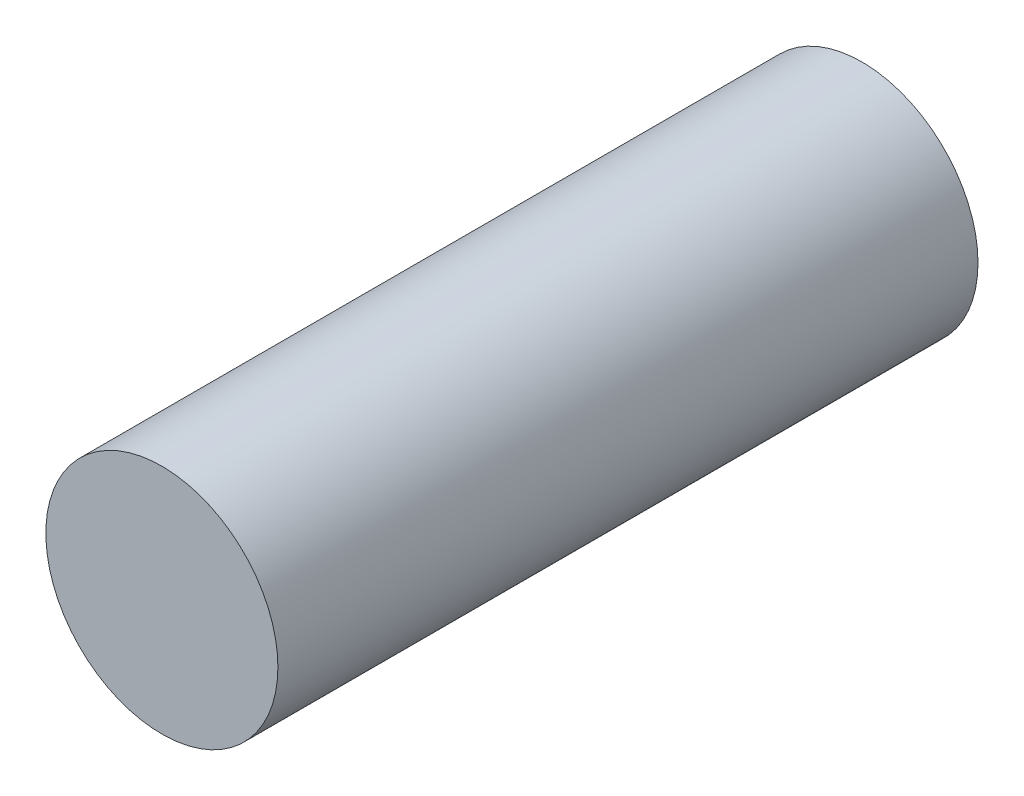
ISO-10303-21;
HEADER;
FILE_DESCRIPTION(('STEP AP214'),'2;1');
FILE_NAME('part.step','',(''),(''),'','','');
FILE_SCHEMA(('AUTOMOTIVE_DESIGN { 1 0 10303 214 1 1 1 1 }'));
ENDSEC;
DATA;
#1=APPLICATION_CONTEXT('core data for automotive mechanical design processes');
#2=APPLICATION_PROTOCOL_DEFINITION('international standard','automotive_design',2000,#1);
#3=PRODUCT_CONTEXT('',#1,'mechanical');
#4=PRODUCT('Part','Part','',(#3));
#5=PRODUCT_RELATED_PRODUCT_CATEGORY('part','',(#4));
#6=PRODUCT_DEFINITION_FORMATION('','',#4);
#7=PRODUCT_DEFINITION_CONTEXT('part definition',#1,'design');
#8=PRODUCT_DEFINITION('design','',#6,#7);
#9=PRODUCT_DEFINITION_SHAPE('','',#8);
#10=(LENGTH_UNIT() NAMED_UNIT(*) SI_UNIT(.MILLI.,.METRE.));
#11=(NAMED_UNIT(*) PLANE_ANGLE_UNIT() SI_UNIT($,.RADIAN.));
#12=(NAMED_UNIT(*) SI_UNIT($,.STERADIAN.) SOLID_ANGLE_UNIT());
#13=UNCERTAINTY_MEASURE_WITH_UNIT(LENGTH_MEASURE(1.E-05),#10,'distance_accuracy_value','');
#14=(GEOMETRIC_REPRESENTATION_CONTEXT(3) GLOBAL_UNCERTAINTY_ASSIGNED_CONTEXT((#13)) GLOBAL_UNIT_ASSIGNED_CONTEXT((#10,
#11,#12)) REPRESENTATION_CONTEXT('',''));
#15=CARTESIAN_POINT('',(0.,0.,0.));
#16=DIRECTION('',(0.,0.,1.));
#17=DIRECTION('',(1.,0.,0.));
#18=AXIS2_PLACEMENT_3D('',#15,#16,#17);
#19=CARTESIAN_POINT('',(0.,0.,-9.779));
#20=DIRECTION('',(0.,0.,1.));
#21=DIRECTION('',(1.,0.,0.));
#22=AXIS2_PLACEMENT_3D('',#19,#20,#21);
#23=PLANE('',#22);
#24=CARTESIAN_POINT('',(0.,0.,-9.779));
#25=DIRECTION('',(0.,0.,1.));
#26=DIRECTION('',(1.,0.,0.));
#27=AXIS2_PLACEMENT_3D('',#24,#25,#26);
#28=CIRCLE('',#27,3.175);
#29=CARTESIAN_POINT('',(3.175,0.,-9.779));
#30=VERTEX_POINT('',#29);
#31=EDGE_CURVE('E17',#30,#30,#28,.T.);
#32=ORIENTED_EDGE('',*,*,#31,.F.);
#33=EDGE_LOOP('',(#32));
#34=FACE_BOUND('',#33,.T.);
#35=ADVANCED_FACE('F13',(#34),#23,.F.);
#36=CARTESIAN_POINT('',(0.,0.,9.379));
#37=DIRECTION('',(0.,0.,1.));
#38=DIRECTION('',(1.,0.,0.));
#39=AXIS2_PLACEMENT_3D('',#36,#37,#38);
#40=PLANE('',#39);
#41=CARTESIAN_POINT('',(0.,0.,9.379));
#42=DIRECTION('',(0.,0.,1.));
#43=DIRECTION('',(1.,0.,0.));
#44=AXIS2_PLACEMENT_3D('',#41,#42,#43);
#45=CIRCLE('',#44,3.175);
#46=CARTESIAN_POINT('',(3.175,0.,9.379));
#47=VERTEX_POINT('',#46);
#48=EDGE_CURVE('E9',#47,#47,#45,.T.);
#49=ORIENTED_EDGE('',*,*,#48,.T.);
#50=EDGE_LOOP('',(#49));
#51=FACE_BOUND('',#50,.T.);
#52=ADVANCED_FACE('F15',(#51),#40,.T.);
#53=CARTESIAN_POINT('',(0.,0.,-12.465));
#54=DIRECTION('',(0.,0.,1.));
#55=DIRECTION('',(1.,0.,0.));
#56=AXIS2_PLACEMENT_3D('',#53,#54,#55);
#57=CYLINDRICAL_SURFACE('',#56,3.175);
#58=ORIENTED_EDGE('',*,*,#48,.F.);
#59=EDGE_LOOP('',(#58));
#60=FACE_BOUND('',#59,.T.);
#61=ORIENTED_EDGE('',*,*,#31,.T.);
#62=EDGE_LOOP('',(#61));
#63=FACE_BOUND('',#62,.T.);
#64=ADVANCED_FACE('F26',(#60,#63),#57,.T.);
#65=CLOSED_SHELL('',(#35,#52,#64));
#66=MANIFOLD_SOLID_BREP('B1',#65);
#67=ADVANCED_BREP_SHAPE_REPRESENTATION('',(#18,#66),#14);
#68=SHAPE_DEFINITION_REPRESENTATION(#9,#67);
ENDSEC;
END-ISO-10303-21;
